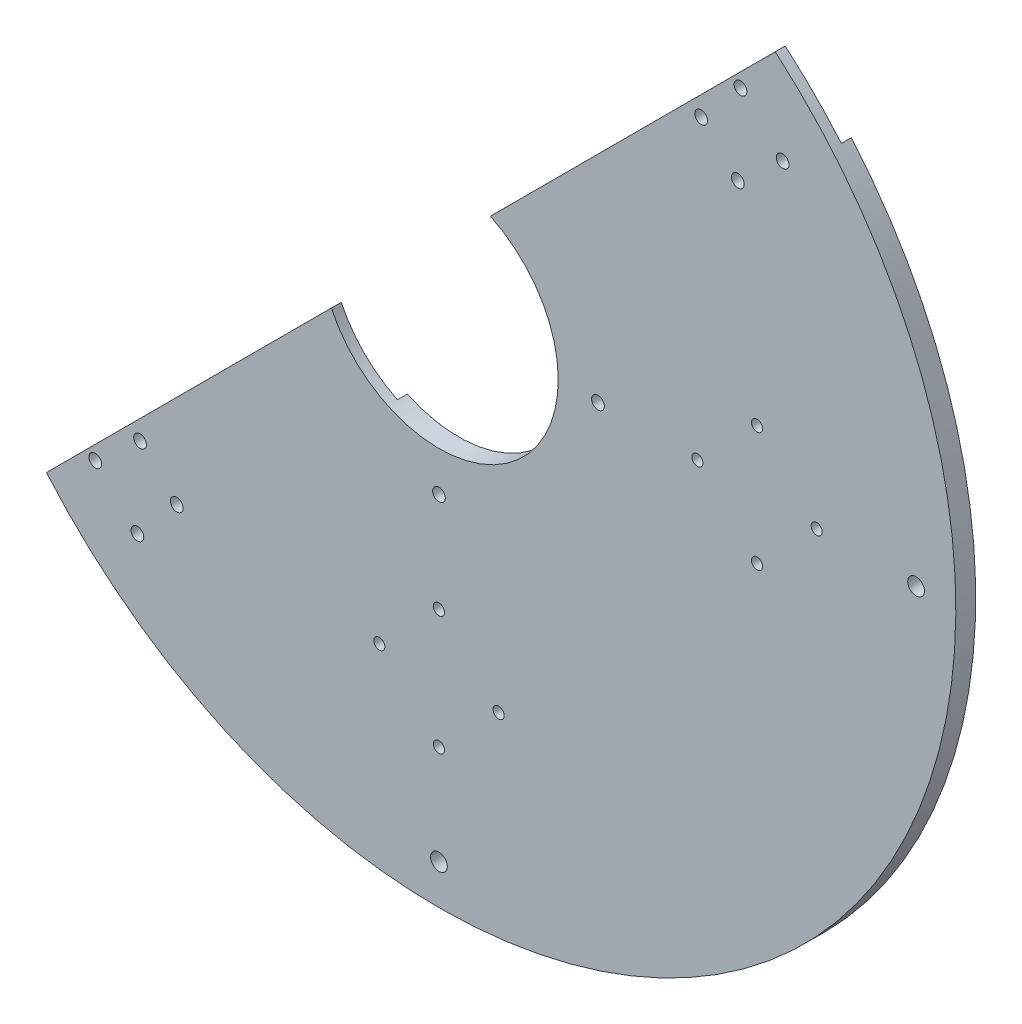
ISO-10303-21;
HEADER;
FILE_DESCRIPTION(('STEP AP214'),'2;1');
FILE_NAME('part.step','',(''),(''),'','','');
FILE_SCHEMA(('AUTOMOTIVE_DESIGN { 1 0 10303 214 1 1 1 1 }'));
ENDSEC;
DATA;
#1=APPLICATION_CONTEXT('core data for automotive mechanical design processes');
#2=APPLICATION_PROTOCOL_DEFINITION('international standard','automotive_design',2000,#1);
#3=PRODUCT_CONTEXT('',#1,'mechanical');
#4=PRODUCT('Part','Part','',(#3));
#5=PRODUCT_RELATED_PRODUCT_CATEGORY('part','',(#4));
#6=PRODUCT_DEFINITION_FORMATION('','',#4);
#7=PRODUCT_DEFINITION_CONTEXT('part definition',#1,'design');
#8=PRODUCT_DEFINITION('design','',#6,#7);
#9=PRODUCT_DEFINITION_SHAPE('','',#8);
#10=(LENGTH_UNIT() NAMED_UNIT(*) SI_UNIT(.MILLI.,.METRE.));
#11=(NAMED_UNIT(*) PLANE_ANGLE_UNIT() SI_UNIT($,.RADIAN.));
#12=(NAMED_UNIT(*) SI_UNIT($,.STERADIAN.) SOLID_ANGLE_UNIT());
#13=UNCERTAINTY_MEASURE_WITH_UNIT(LENGTH_MEASURE(1.E-05),#10,'distance_accuracy_value','');
#14=(GEOMETRIC_REPRESENTATION_CONTEXT(3) GLOBAL_UNCERTAINTY_ASSIGNED_CONTEXT((#13)) GLOBAL_UNIT_ASSIGNED_CONTEXT((#10,
#11,#12)) REPRESENTATION_CONTEXT('',''));
#15=CARTESIAN_POINT('',(0.,0.,0.));
#16=DIRECTION('',(0.,0.,1.));
#17=DIRECTION('',(1.,0.,0.));
#18=AXIS2_PLACEMENT_3D('',#15,#16,#17);
#19=CARTESIAN_POINT('',(0.,0.,5.));
#20=DIRECTION('',(0.,0.,1.));
#21=DIRECTION('',(1.,0.,0.));
#22=AXIS2_PLACEMENT_3D('',#19,#20,#21);
#23=PLANE('',#22);
#24=DIRECTION('',(0.707106781186549,0.707106781186546,0.));
#25=VECTOR('',#24,1.);
#26=CARTESIAN_POINT('',(-137.071067811866,-122.928932188134,5.));
#27=LINE('',#26,#25);
#28=CARTESIAN_POINT('',(-98.7225817109825,-84.5804460872511,5.));
#29=VERTEX_POINT('',#28);
#30=CARTESIAN_POINT('',(-27.0710678118655,-12.9289321881345,5.));
#31=VERTEX_POINT('',#30);
#32=EDGE_CURVE('E63',#29,#31,#27,.T.);
#33=ORIENTED_EDGE('',*,*,#32,.F.);
#34=CARTESIAN_POINT('',(0.,0.,5.));
#35=DIRECTION('',(0.,0.,1.));
#36=DIRECTION('',(1.,0.,0.));
#37=AXIS2_PLACEMENT_3D('',#34,#35,#36);
#38=CIRCLE('',#37,130.);
#39=CARTESIAN_POINT('',(84.5804460872515,98.7225817109821,5.));
#40=VERTEX_POINT('',#39);
#41=EDGE_CURVE('E127',#29,#40,#38,.T.);
#42=ORIENTED_EDGE('',*,*,#41,.T.);
#43=CARTESIAN_POINT('',(12.9289321881346,27.0710678118655,5.));
#44=VERTEX_POINT('',#43);
#45=EDGE_CURVE('E289',#44,#40,#27,.T.);
#46=ORIENTED_EDGE('',*,*,#45,.F.);
#47=CARTESIAN_POINT('',(0.,0.,5.));
#48=DIRECTION('',(0.,0.,1.));
#49=DIRECTION('',(1.,0.,0.));
#50=AXIS2_PLACEMENT_3D('',#47,#48,#49);
#51=CIRCLE('',#50,30.);
#52=EDGE_CURVE('E234',#31,#44,#51,.T.);
#53=ORIENTED_EDGE('',*,*,#52,.F.);
#54=EDGE_LOOP('',(#33,#42,#46,#53));
#55=FACE_BOUND('',#54,.T.);
#56=CARTESIAN_POINT('',(75.8408609766883,86.4474626944865,5.));
#57=DIRECTION('',(0.,0.,1.));
#58=DIRECTION('',(1.,0.,0.));
#59=AXIS2_PLACEMENT_3D('',#56,#57,#58);
#60=CIRCLE('',#59,1.60000000000001);
#61=CARTESIAN_POINT('',(77.4408609766883,86.4474626944865,5.));
#62=VERTEX_POINT('',#61);
#63=EDGE_CURVE('E138',#62,#62,#60,.F.);
#64=ORIENTED_EDGE('',*,*,#63,.T.);
#65=EDGE_LOOP('',(#64));
#66=FACE_BOUND('',#65,.T.);
#67=CARTESIAN_POINT('',(86.4474626944865,75.8408609766883,5.));
#68=DIRECTION('',(0.,0.,1.));
#69=DIRECTION('',(1.,0.,0.));
#70=AXIS2_PLACEMENT_3D('',#67,#68,#69);
#71=CIRCLE('',#70,1.60000000000001);
#72=CARTESIAN_POINT('',(88.0474626944865,75.8408609766883,5.));
#73=VERTEX_POINT('',#72);
#74=EDGE_CURVE('E142',#73,#73,#71,.F.);
#75=ORIENTED_EDGE('',*,*,#74,.T.);
#76=EDGE_LOOP('',(#75));
#77=FACE_BOUND('',#76,.T.);
#78=CARTESIAN_POINT('',(65.9485747623375,75.1717066908579,5.));
#79=DIRECTION('',(0.,0.,1.));
#80=DIRECTION('',(1.,0.,0.));
#81=AXIS2_PLACEMENT_3D('',#78,#79,#80);
#82=CIRCLE('',#81,1.60000000000001);
#83=CARTESIAN_POINT('',(67.5485747623375,75.1717066908579,5.));
#84=VERTEX_POINT('',#83);
#85=EDGE_CURVE('E145',#84,#84,#82,.F.);
#86=ORIENTED_EDGE('',*,*,#85,.T.);
#87=EDGE_LOOP('',(#86));
#88=FACE_BOUND('',#87,.T.);
#89=CARTESIAN_POINT('',(75.1717066908582,65.9485747623372,5.));
#90=DIRECTION('',(0.,0.,1.));
#91=DIRECTION('',(1.,0.,0.));
#92=AXIS2_PLACEMENT_3D('',#89,#90,#91);
#93=CIRCLE('',#92,1.60000000000002);
#94=CARTESIAN_POINT('',(76.7717066908582,65.9485747623372,5.));
#95=VERTEX_POINT('',#94);
#96=EDGE_CURVE('E148',#95,#95,#93,.F.);
#97=ORIENTED_EDGE('',*,*,#96,.T.);
#98=EDGE_LOOP('',(#97));
#99=FACE_BOUND('',#98,.T.);
#100=CARTESIAN_POINT('',(-65.948574762337,-75.1717066908584,5.));
#101=DIRECTION('',(0.,0.,1.));
#102=DIRECTION('',(1.,0.,0.));
#103=AXIS2_PLACEMENT_3D('',#100,#101,#102);
#104=CIRCLE('',#103,1.60000000000005);
#105=CARTESIAN_POINT('',(-64.348574762337,-75.1717066908584,5.));
#106=VERTEX_POINT('',#105);
#107=EDGE_CURVE('E151',#106,#106,#104,.F.);
#108=ORIENTED_EDGE('',*,*,#107,.T.);
#109=EDGE_LOOP('',(#108));
#110=FACE_BOUND('',#109,.T.);
#111=CARTESIAN_POINT('',(-75.1717066908577,-65.9485747623378,5.));
#112=DIRECTION('',(0.,0.,1.));
#113=DIRECTION('',(1.,0.,0.));
#114=AXIS2_PLACEMENT_3D('',#111,#112,#113);
#115=CIRCLE('',#114,1.60000000000003);
#116=CARTESIAN_POINT('',(-73.5717066908577,-65.9485747623378,5.));
#117=VERTEX_POINT('',#116);
#118=EDGE_CURVE('E154',#117,#117,#115,.F.);
#119=ORIENTED_EDGE('',*,*,#118,.T.);
#120=EDGE_LOOP('',(#119));
#121=FACE_BOUND('',#120,.T.);
#122=CARTESIAN_POINT('',(-75.840860976688,-86.4474626944868,5.));
#123=DIRECTION('',(0.,0.,1.));
#124=DIRECTION('',(1.,0.,0.));
#125=AXIS2_PLACEMENT_3D('',#122,#123,#124);
#126=CIRCLE('',#125,1.60000000000001);
#127=CARTESIAN_POINT('',(-74.240860976688,-86.4474626944868,5.));
#128=VERTEX_POINT('',#127);
#129=EDGE_CURVE('E157',#128,#128,#126,.F.);
#130=ORIENTED_EDGE('',*,*,#129,.T.);
#131=EDGE_LOOP('',(#130));
#132=FACE_BOUND('',#131,.T.);
#133=CARTESIAN_POINT('',(-86.4474626944863,-75.8408609766886,5.));
#134=DIRECTION('',(0.,0.,1.));
#135=DIRECTION('',(1.,0.,0.));
#136=AXIS2_PLACEMENT_3D('',#133,#134,#135);
#137=CIRCLE('',#136,1.60000000000001);
#138=CARTESIAN_POINT('',(-84.8474626944863,-75.8408609766886,5.));
#139=VERTEX_POINT('',#138);
#140=EDGE_CURVE('E137',#139,#139,#137,.F.);
#141=ORIENTED_EDGE('',*,*,#140,.T.);
#142=EDGE_LOOP('',(#141));
#143=FACE_BOUND('',#142,.T.);
#144=CARTESIAN_POINT('',(15.0000000000036,-80.,5.));
#145=DIRECTION('',(0.,0.,1.));
#146=DIRECTION('',(1.,0.,0.));
#147=AXIS2_PLACEMENT_3D('',#144,#145,#146);
#148=CIRCLE('',#147,1.39999999999878);
#149=CARTESIAN_POINT('',(16.4000000000024,-80.,5.));
#150=VERTEX_POINT('',#149);
#151=EDGE_CURVE('E206',#150,#150,#148,.T.);
#152=ORIENTED_EDGE('',*,*,#151,.F.);
#153=EDGE_LOOP('',(#152));
#154=FACE_BOUND('',#153,.T.);
#155=CARTESIAN_POINT('',(3.60479211679609E-12,-65.,5.));
#156=DIRECTION('',(0.,0.,1.));
#157=DIRECTION('',(1.,0.,0.));
#158=AXIS2_PLACEMENT_3D('',#155,#156,#157);
#159=CIRCLE('',#158,1.39999999999582);
#160=CARTESIAN_POINT('',(1.39999999999942,-65.,5.));
#161=VERTEX_POINT('',#160);
#162=EDGE_CURVE('E203',#161,#161,#159,.T.);
#163=ORIENTED_EDGE('',*,*,#162,.F.);
#164=EDGE_LOOP('',(#163));
#165=FACE_BOUND('',#164,.T.);
#166=CARTESIAN_POINT('',(-14.9999999999964,-80.,5.));
#167=DIRECTION('',(0.,0.,1.));
#168=DIRECTION('',(1.,0.,0.));
#169=AXIS2_PLACEMENT_3D('',#166,#167,#168);
#170=CIRCLE('',#169,1.40000000000123);
#171=CARTESIAN_POINT('',(-13.5999999999952,-80.,5.));
#172=VERTEX_POINT('',#171);
#173=EDGE_CURVE('E200',#172,#172,#170,.T.);
#174=ORIENTED_EDGE('',*,*,#173,.F.);
#175=EDGE_LOOP('',(#174));
#176=FACE_BOUND('',#175,.T.);
#177=CARTESIAN_POINT('',(95.0000000000018,1.80515151369613E-12,5.));
#178=DIRECTION('',(0.,0.,1.));
#179=DIRECTION('',(1.,0.,0.));
#180=AXIS2_PLACEMENT_3D('',#177,#178,#179);
#181=CIRCLE('',#180,1.40000000000152);
#182=CARTESIAN_POINT('',(96.4000000000033,1.80515151369613E-12,5.));
#183=VERTEX_POINT('',#182);
#184=EDGE_CURVE('E197',#183,#183,#181,.T.);
#185=ORIENTED_EDGE('',*,*,#184,.F.);
#186=EDGE_LOOP('',(#185));
#187=FACE_BOUND('',#186,.T.);
#188=CARTESIAN_POINT('',(3.61030302739226E-12,-95.,5.));
#189=DIRECTION('',(0.,0.,1.));
#190=DIRECTION('',(1.,0.,0.));
#191=AXIS2_PLACEMENT_3D('',#188,#189,#190);
#192=CIRCLE('',#191,1.40000000000409);
#193=CARTESIAN_POINT('',(1.4000000000077,-95.,5.));
#194=VERTEX_POINT('',#193);
#195=EDGE_CURVE('E194',#194,#194,#192,.T.);
#196=ORIENTED_EDGE('',*,*,#195,.F.);
#197=EDGE_LOOP('',(#196));
#198=FACE_BOUND('',#197,.T.);
#199=CARTESIAN_POINT('',(80.0000000000018,15.0000000000018,5.));
#200=DIRECTION('',(0.,0.,1.));
#201=DIRECTION('',(1.,0.,0.));
#202=AXIS2_PLACEMENT_3D('',#199,#200,#201);
#203=CIRCLE('',#202,1.39999999999761);
#204=CARTESIAN_POINT('',(81.3999999999994,15.0000000000018,5.));
#205=VERTEX_POINT('',#204);
#206=EDGE_CURVE('E191',#205,#205,#203,.T.);
#207=ORIENTED_EDGE('',*,*,#206,.F.);
#208=EDGE_LOOP('',(#207));
#209=FACE_BOUND('',#208,.T.);
#210=CARTESIAN_POINT('',(65.0000000000018,1.80147757329869E-12,5.));
#211=DIRECTION('',(0.,0.,1.));
#212=DIRECTION('',(1.,0.,0.));
#213=AXIS2_PLACEMENT_3D('',#210,#211,#212);
#214=CIRCLE('',#213,1.39999999999829);
#215=CARTESIAN_POINT('',(66.4000000000001,1.80147757329869E-12,5.));
#216=VERTEX_POINT('',#215);
#217=EDGE_CURVE('E188',#216,#216,#214,.T.);
#218=ORIENTED_EDGE('',*,*,#217,.F.);
#219=EDGE_LOOP('',(#218));
#220=FACE_BOUND('',#219,.T.);
#221=CARTESIAN_POINT('',(80.0000000000018,-14.9999999999982,5.));
#222=DIRECTION('',(0.,0.,1.));
#223=DIRECTION('',(1.,0.,0.));
#224=AXIS2_PLACEMENT_3D('',#221,#222,#223);
#225=CIRCLE('',#224,1.40000000000229);
#226=CARTESIAN_POINT('',(81.4000000000041,-14.9999999999982,5.));
#227=VERTEX_POINT('',#226);
#228=EDGE_CURVE('E185',#227,#227,#225,.T.);
#229=ORIENTED_EDGE('',*,*,#228,.F.);
#230=EDGE_LOOP('',(#229));
#231=FACE_BOUND('',#230,.T.);
#232=CARTESIAN_POINT('',(-2.79318507107451E-13,-40.,5.));
#233=DIRECTION('',(0.,0.,1.));
#234=DIRECTION('',(1.,0.,0.));
#235=AXIS2_PLACEMENT_3D('',#232,#233,#234);
#236=CIRCLE('',#235,1.6);
#237=CARTESIAN_POINT('',(1.59999999999972,-40.,5.));
#238=VERTEX_POINT('',#237);
#239=EDGE_CURVE('E210',#238,#238,#236,.T.);
#240=ORIENTED_EDGE('',*,*,#239,.F.);
#241=EDGE_LOOP('',(#240));
#242=FACE_BOUND('',#241,.T.);
#243=CARTESIAN_POINT('',(120.,-4.18977760661176E-13,5.));
#244=DIRECTION('',(0.,0.,1.));
#245=DIRECTION('',(1.,0.,0.));
#246=AXIS2_PLACEMENT_3D('',#243,#244,#245);
#247=CIRCLE('',#246,2.1);
#248=CARTESIAN_POINT('',(122.1,-4.18977760661176E-13,5.));
#249=VERTEX_POINT('',#248);
#250=EDGE_CURVE('E228',#249,#249,#247,.T.);
#251=ORIENTED_EDGE('',*,*,#250,.F.);
#252=EDGE_LOOP('',(#251));
#253=FACE_BOUND('',#252,.T.);
#254=CARTESIAN_POINT('',(-8.37955521322352E-13,-120.,5.));
#255=DIRECTION('',(0.,0.,1.));
#256=DIRECTION('',(1.,0.,0.));
#257=AXIS2_PLACEMENT_3D('',#254,#255,#256);
#258=CIRCLE('',#257,2.1);
#259=CARTESIAN_POINT('',(2.09999999999916,-120.,5.));
#260=VERTEX_POINT('',#259);
#261=EDGE_CURVE('E222',#260,#260,#258,.T.);
#262=ORIENTED_EDGE('',*,*,#261,.F.);
#263=EDGE_LOOP('',(#262));
#264=FACE_BOUND('',#263,.T.);
#265=CARTESIAN_POINT('',(40.,-1.39659253553725E-13,5.));
#266=DIRECTION('',(0.,0.,1.));
#267=DIRECTION('',(1.,0.,0.));
#268=AXIS2_PLACEMENT_3D('',#265,#266,#267);
#269=CIRCLE('',#268,1.6);
#270=CARTESIAN_POINT('',(41.6,-1.39659253553725E-13,5.));
#271=VERTEX_POINT('',#270);
#272=EDGE_CURVE('E216',#271,#271,#269,.T.);
#273=ORIENTED_EDGE('',*,*,#272,.F.);
#274=EDGE_LOOP('',(#273));
#275=FACE_BOUND('',#274,.T.);
#276=ADVANCED_FACE('F40',(#55,#66,#77,#88,#99,#110,#121,#132,#143,#154,#165,#176,#187,#198,#209,
#220,#231,#242,#253,#264,#275),#23,.T.);
#277=CARTESIAN_POINT('',(0.,0.,0.));
#278=DIRECTION('',(0.,0.,1.));
#279=DIRECTION('',(1.,0.,0.));
#280=AXIS2_PLACEMENT_3D('',#277,#278,#279);
#281=PLANE('',#280);
#282=CARTESIAN_POINT('',(15.0000000000036,-80.,0.));
#283=DIRECTION('',(0.,0.,1.));
#284=DIRECTION('',(1.,0.,0.));
#285=AXIS2_PLACEMENT_3D('',#282,#283,#284);
#286=CIRCLE('',#285,1.39999999999878);
#287=CARTESIAN_POINT('',(16.4000000000024,-80.,0.));
#288=VERTEX_POINT('',#287);
#289=EDGE_CURVE('E141',#288,#288,#286,.T.);
#290=ORIENTED_EDGE('',*,*,#289,.T.);
#291=EDGE_LOOP('',(#290));
#292=FACE_BOUND('',#291,.T.);
#293=CARTESIAN_POINT('',(3.60479211679609E-12,-65.,0.));
#294=DIRECTION('',(0.,0.,1.));
#295=DIRECTION('',(1.,0.,0.));
#296=AXIS2_PLACEMENT_3D('',#293,#294,#295);
#297=CIRCLE('',#296,1.39999999999582);
#298=CARTESIAN_POINT('',(1.39999999999942,-65.,0.));
#299=VERTEX_POINT('',#298);
#300=EDGE_CURVE('E164',#299,#299,#297,.T.);
#301=ORIENTED_EDGE('',*,*,#300,.T.);
#302=EDGE_LOOP('',(#301));
#303=FACE_BOUND('',#302,.T.);
#304=CARTESIAN_POINT('',(-14.9999999999964,-80.,0.));
#305=DIRECTION('',(0.,0.,1.));
#306=DIRECTION('',(1.,0.,0.));
#307=AXIS2_PLACEMENT_3D('',#304,#305,#306);
#308=CIRCLE('',#307,1.40000000000123);
#309=CARTESIAN_POINT('',(-13.5999999999952,-80.,0.));
#310=VERTEX_POINT('',#309);
#311=EDGE_CURVE('E165',#310,#310,#308,.T.);
#312=ORIENTED_EDGE('',*,*,#311,.T.);
#313=EDGE_LOOP('',(#312));
#314=FACE_BOUND('',#313,.T.);
#315=CARTESIAN_POINT('',(95.0000000000018,1.80515151369613E-12,0.));
#316=DIRECTION('',(0.,0.,1.));
#317=DIRECTION('',(1.,0.,0.));
#318=AXIS2_PLACEMENT_3D('',#315,#316,#317);
#319=CIRCLE('',#318,1.40000000000152);
#320=CARTESIAN_POINT('',(96.4000000000033,1.80515151369613E-12,0.));
#321=VERTEX_POINT('',#320);
#322=EDGE_CURVE('E180',#321,#321,#319,.T.);
#323=ORIENTED_EDGE('',*,*,#322,.T.);
#324=EDGE_LOOP('',(#323));
#325=FACE_BOUND('',#324,.T.);
#326=CARTESIAN_POINT('',(3.61030302739226E-12,-95.,0.));
#327=DIRECTION('',(0.,0.,1.));
#328=DIRECTION('',(1.,0.,0.));
#329=AXIS2_PLACEMENT_3D('',#326,#327,#328);
#330=CIRCLE('',#329,1.40000000000409);
#331=CARTESIAN_POINT('',(1.4000000000077,-95.,0.));
#332=VERTEX_POINT('',#331);
#333=EDGE_CURVE('E168',#332,#332,#330,.T.);
#334=ORIENTED_EDGE('',*,*,#333,.T.);
#335=EDGE_LOOP('',(#334));
#336=FACE_BOUND('',#335,.T.);
#337=CARTESIAN_POINT('',(80.0000000000018,15.0000000000018,0.));
#338=DIRECTION('',(0.,0.,1.));
#339=DIRECTION('',(1.,0.,0.));
#340=AXIS2_PLACEMENT_3D('',#337,#338,#339);
#341=CIRCLE('',#340,1.39999999999761);
#342=CARTESIAN_POINT('',(81.3999999999994,15.0000000000018,0.));
#343=VERTEX_POINT('',#342);
#344=EDGE_CURVE('E171',#343,#343,#341,.T.);
#345=ORIENTED_EDGE('',*,*,#344,.T.);
#346=EDGE_LOOP('',(#345));
#347=FACE_BOUND('',#346,.T.);
#348=CARTESIAN_POINT('',(65.0000000000018,1.80147757329869E-12,0.));
#349=DIRECTION('',(0.,0.,1.));
#350=DIRECTION('',(1.,0.,0.));
#351=AXIS2_PLACEMENT_3D('',#348,#349,#350);
#352=CIRCLE('',#351,1.39999999999829);
#353=CARTESIAN_POINT('',(66.4000000000001,1.80147757329869E-12,0.));
#354=VERTEX_POINT('',#353);
#355=EDGE_CURVE('E174',#354,#354,#352,.T.);
#356=ORIENTED_EDGE('',*,*,#355,.T.);
#357=EDGE_LOOP('',(#356));
#358=FACE_BOUND('',#357,.T.);
#359=CARTESIAN_POINT('',(80.0000000000018,-14.9999999999982,0.));
#360=DIRECTION('',(0.,0.,1.));
#361=DIRECTION('',(1.,0.,0.));
#362=AXIS2_PLACEMENT_3D('',#359,#360,#361);
#363=CIRCLE('',#362,1.40000000000229);
#364=CARTESIAN_POINT('',(81.4000000000041,-14.9999999999982,0.));
#365=VERTEX_POINT('',#364);
#366=EDGE_CURVE('E177',#365,#365,#363,.T.);
#367=ORIENTED_EDGE('',*,*,#366,.T.);
#368=EDGE_LOOP('',(#367));
#369=FACE_BOUND('',#368,.T.);
#370=CARTESIAN_POINT('',(0.,0.,0.));
#371=DIRECTION('',(0.,0.,1.));
#372=DIRECTION('',(1.,0.,0.));
#373=AXIS2_PLACEMENT_3D('',#370,#371,#372);
#374=CIRCLE('',#373,130.);
#375=CARTESIAN_POINT('',(-84.5804460872575,-98.7225817109752,0.));
#376=VERTEX_POINT('',#375);
#377=CARTESIAN_POINT('',(98.7225817109754,84.580446087257,0.));
#378=VERTEX_POINT('',#377);
#379=EDGE_CURVE('E237',#376,#378,#374,.T.);
#380=ORIENTED_EDGE('',*,*,#379,.F.);
#381=DIRECTION('',(0.707106781186549,0.707106781186546,0.));
#382=VECTOR('',#381,1.);
#383=CARTESIAN_POINT('',(-122.928932188141,-137.071067811859,0.));
#384=LINE('',#383,#382);
#385=CARTESIAN_POINT('',(-12.9289321881387,-27.0710678118567,0.));
#386=VERTEX_POINT('',#385);
#387=EDGE_CURVE('E247',#376,#386,#384,.T.);
#388=ORIENTED_EDGE('',*,*,#387,.T.);
#389=CARTESIAN_POINT('',(0.,0.,0.));
#390=DIRECTION('',(0.,0.,1.));
#391=DIRECTION('',(1.,0.,0.));
#392=AXIS2_PLACEMENT_3D('',#389,#390,#391);
#393=CIRCLE('',#392,30.);
#394=CARTESIAN_POINT('',(27.0710678118568,12.9289321881386,0.));
#395=VERTEX_POINT('',#394);
#396=EDGE_CURVE('E231',#386,#395,#393,.T.);
#397=ORIENTED_EDGE('',*,*,#396,.T.);
#398=EDGE_CURVE('E256',#395,#378,#384,.T.);
#399=ORIENTED_EDGE('',*,*,#398,.T.);
#400=EDGE_LOOP('',(#380,#388,#397,#399));
#401=FACE_BOUND('',#400,.T.);
#402=CARTESIAN_POINT('',(120.,-4.18977760661176E-13,0.));
#403=DIRECTION('',(0.,0.,1.));
#404=DIRECTION('',(1.,0.,0.));
#405=AXIS2_PLACEMENT_3D('',#402,#403,#404);
#406=CIRCLE('',#405,2.1);
#407=CARTESIAN_POINT('',(122.1,-4.18977760661176E-13,0.));
#408=VERTEX_POINT('',#407);
#409=EDGE_CURVE('E225',#408,#408,#406,.T.);
#410=ORIENTED_EDGE('',*,*,#409,.T.);
#411=EDGE_LOOP('',(#410));
#412=FACE_BOUND('',#411,.T.);
#413=CARTESIAN_POINT('',(-8.37955521322352E-13,-120.,0.));
#414=DIRECTION('',(0.,0.,1.));
#415=DIRECTION('',(1.,0.,0.));
#416=AXIS2_PLACEMENT_3D('',#413,#414,#415);
#417=CIRCLE('',#416,2.1);
#418=CARTESIAN_POINT('',(2.09999999999916,-120.,0.));
#419=VERTEX_POINT('',#418);
#420=EDGE_CURVE('E219',#419,#419,#417,.T.);
#421=ORIENTED_EDGE('',*,*,#420,.T.);
#422=EDGE_LOOP('',(#421));
#423=FACE_BOUND('',#422,.T.);
#424=CARTESIAN_POINT('',(40.,-1.39659253553725E-13,0.));
#425=DIRECTION('',(0.,0.,1.));
#426=DIRECTION('',(1.,0.,0.));
#427=AXIS2_PLACEMENT_3D('',#424,#425,#426);
#428=CIRCLE('',#427,1.6);
#429=CARTESIAN_POINT('',(41.6,-1.39659253553725E-13,0.));
#430=VERTEX_POINT('',#429);
#431=EDGE_CURVE('E213',#430,#430,#428,.T.);
#432=ORIENTED_EDGE('',*,*,#431,.T.);
#433=EDGE_LOOP('',(#432));
#434=FACE_BOUND('',#433,.T.);
#435=CARTESIAN_POINT('',(-2.79318507107451E-13,-40.,0.));
#436=DIRECTION('',(0.,0.,1.));
#437=DIRECTION('',(1.,0.,0.));
#438=AXIS2_PLACEMENT_3D('',#435,#436,#437);
#439=CIRCLE('',#438,1.6);
#440=CARTESIAN_POINT('',(1.59999999999972,-40.,0.));
#441=VERTEX_POINT('',#440);
#442=EDGE_CURVE('E209',#441,#441,#439,.T.);
#443=ORIENTED_EDGE('',*,*,#442,.T.);
#444=EDGE_LOOP('',(#443));
#445=FACE_BOUND('',#444,.T.);
#446=ADVANCED_FACE('F296',(#292,#303,#314,#325,#336,#347,#358,#369,#401,#412,#423,#434,#445),
#281,.F.);
#447=CARTESIAN_POINT('',(0.,0.,5.));
#448=DIRECTION('',(0.,0.,-1.));
#449=DIRECTION('',(-1.,0.,0.));
#450=AXIS2_PLACEMENT_3D('',#447,#448,#449);
#451=CYLINDRICAL_SURFACE('',#450,130.);
#452=ORIENTED_EDGE('',*,*,#379,.T.);
#453=DIRECTION('',(0.,0.,-1.));
#454=VECTOR('',#453,1.);
#455=CARTESIAN_POINT('',(98.7225817109884,84.5804460872442,4.99999999996357));
#456=LINE('',#455,#454);
#457=CARTESIAN_POINT('',(98.7225817109824,84.5804460872512,2.5));
#458=VERTEX_POINT('',#457);
#459=EDGE_CURVE('E128',#378,#458,#456,.F.);
#460=ORIENTED_EDGE('',*,*,#459,.T.);
#461=CARTESIAN_POINT('',(0.,0.,2.5));
#462=DIRECTION('',(0.,0.,1.));
#463=DIRECTION('',(1.,0.,0.));
#464=AXIS2_PLACEMENT_3D('',#461,#462,#463);
#465=CIRCLE('',#464,130.);
#466=CARTESIAN_POINT('',(84.5804460872515,98.7225817109821,2.5));
#467=VERTEX_POINT('',#466);
#468=EDGE_CURVE('E116',#458,#467,#465,.T.);
#469=ORIENTED_EDGE('',*,*,#468,.T.);
#470=DIRECTION('',(0.,0.,-1.));
#471=VECTOR('',#470,1.);
#472=CARTESIAN_POINT('',(84.5804460872515,98.7225817109821,5.));
#473=LINE('',#472,#471);
#474=EDGE_CURVE('E129',#467,#40,#473,.F.);
#475=ORIENTED_EDGE('',*,*,#474,.T.);
#476=ORIENTED_EDGE('',*,*,#41,.F.);
#477=DIRECTION('',(0.,0.,-1.));
#478=VECTOR('',#477,1.);
#479=CARTESIAN_POINT('',(-98.7225817109825,-84.5804460872511,5.));
#480=LINE('',#479,#478);
#481=CARTESIAN_POINT('',(-98.7225817109825,-84.5804460872511,2.5));
#482=VERTEX_POINT('',#481);
#483=EDGE_CURVE('E120',#29,#482,#480,.T.);
#484=ORIENTED_EDGE('',*,*,#483,.T.);
#485=CARTESIAN_POINT('',(-84.5804460872515,-98.7225817109821,2.5));
#486=VERTEX_POINT('',#485);
#487=EDGE_CURVE('E106',#482,#486,#465,.T.);
#488=ORIENTED_EDGE('',*,*,#487,.T.);
#489=DIRECTION('',(0.,0.,-1.));
#490=VECTOR('',#489,1.);
#491=CARTESIAN_POINT('',(-84.5804460872446,-98.722581710988,4.99999999996357));
#492=LINE('',#491,#490);
#493=EDGE_CURVE('E132',#486,#376,#492,.T.);
#494=ORIENTED_EDGE('',*,*,#493,.T.);
#495=EDGE_LOOP('',(#452,#460,#469,#475,#476,#484,#488,#494));
#496=FACE_BOUND('',#495,.T.);
#497=ADVANCED_FACE('F42',(#496),#451,.T.);
#498=CARTESIAN_POINT('',(0.,0.,5.));
#499=DIRECTION('',(0.,0.,-1.));
#500=DIRECTION('',(-1.,0.,0.));
#501=AXIS2_PLACEMENT_3D('',#498,#499,#500);
#502=CYLINDRICAL_SURFACE('',#501,30.);
#503=DIRECTION('',(0.,0.,-1.));
#504=VECTOR('',#503,1.);
#505=CARTESIAN_POINT('',(-12.9289321881259,-27.0710678118696,4.99999999996357));
#506=LINE('',#505,#504);
#507=CARTESIAN_POINT('',(-12.9289321881346,-27.0710678118654,2.5));
#508=VERTEX_POINT('',#507);
#509=EDGE_CURVE('E11',#508,#386,#506,.T.);
#510=ORIENTED_EDGE('',*,*,#509,.F.);
#511=CARTESIAN_POINT('',(0.,0.,2.5));
#512=DIRECTION('',(0.,0.,1.));
#513=DIRECTION('',(1.,0.,0.));
#514=AXIS2_PLACEMENT_3D('',#511,#512,#513);
#515=CIRCLE('',#514,30.);
#516=CARTESIAN_POINT('',(-27.0710678118655,-12.9289321881345,2.5));
#517=VERTEX_POINT('',#516);
#518=EDGE_CURVE('E266',#517,#508,#515,.T.);
#519=ORIENTED_EDGE('',*,*,#518,.F.);
#520=DIRECTION('',(0.,0.,-1.));
#521=VECTOR('',#520,1.);
#522=CARTESIAN_POINT('',(-27.0710678118655,-12.9289321881345,5.));
#523=LINE('',#522,#521);
#524=EDGE_CURVE('E48',#31,#517,#523,.T.);
#525=ORIENTED_EDGE('',*,*,#524,.F.);
#526=ORIENTED_EDGE('',*,*,#52,.T.);
#527=DIRECTION('',(0.,0.,-1.));
#528=VECTOR('',#527,1.);
#529=CARTESIAN_POINT('',(12.9289321881346,27.0710678118655,5.));
#530=LINE('',#529,#528);
#531=CARTESIAN_POINT('',(12.9289321881346,27.0710678118655,2.5));
#532=VERTEX_POINT('',#531);
#533=EDGE_CURVE('E241',#532,#44,#530,.F.);
#534=ORIENTED_EDGE('',*,*,#533,.F.);
#535=CARTESIAN_POINT('',(27.0710678118655,12.9289321881345,2.5));
#536=VERTEX_POINT('',#535);
#537=EDGE_CURVE('E117',#536,#532,#515,.T.);
#538=ORIENTED_EDGE('',*,*,#537,.F.);
#539=DIRECTION('',(0.,0.,-1.));
#540=VECTOR('',#539,1.);
#541=CARTESIAN_POINT('',(27.0710678118697,12.9289321881258,4.99999999996357));
#542=LINE('',#541,#540);
#543=EDGE_CURVE('E249',#395,#536,#542,.F.);
#544=ORIENTED_EDGE('',*,*,#543,.F.);
#545=ORIENTED_EDGE('',*,*,#396,.F.);
#546=EDGE_LOOP('',(#510,#519,#525,#526,#534,#538,#544,#545));
#547=FACE_BOUND('',#546,.T.);
#548=ADVANCED_FACE('F265',(#547),#502,.F.);
#549=CARTESIAN_POINT('',(120.,-4.18977760661176E-13,5.));
#550=DIRECTION('',(0.,0.,-1.));
#551=DIRECTION('',(-1.,0.,0.));
#552=AXIS2_PLACEMENT_3D('',#549,#550,#551);
#553=CYLINDRICAL_SURFACE('',#552,2.1);
#554=ORIENTED_EDGE('',*,*,#250,.T.);
#555=EDGE_LOOP('',(#554));
#556=FACE_BOUND('',#555,.T.);
#557=ORIENTED_EDGE('',*,*,#409,.F.);
#558=EDGE_LOOP('',(#557));
#559=FACE_BOUND('',#558,.T.);
#560=ADVANCED_FACE('F374',(#556,#559),#553,.F.);
#561=CARTESIAN_POINT('',(-8.37955521322352E-13,-120.,5.));
#562=DIRECTION('',(0.,0.,-1.));
#563=DIRECTION('',(-1.,0.,0.));
#564=AXIS2_PLACEMENT_3D('',#561,#562,#563);
#565=CYLINDRICAL_SURFACE('',#564,2.1);
#566=ORIENTED_EDGE('',*,*,#261,.T.);
#567=EDGE_LOOP('',(#566));
#568=FACE_BOUND('',#567,.T.);
#569=ORIENTED_EDGE('',*,*,#420,.F.);
#570=EDGE_LOOP('',(#569));
#571=FACE_BOUND('',#570,.T.);
#572=ADVANCED_FACE('F349',(#568,#571),#565,.F.);
#573=CARTESIAN_POINT('',(40.,-1.39659253553725E-13,5.));
#574=DIRECTION('',(0.,0.,-1.));
#575=DIRECTION('',(-1.,0.,0.));
#576=AXIS2_PLACEMENT_3D('',#573,#574,#575);
#577=CYLINDRICAL_SURFACE('',#576,1.6);
#578=ORIENTED_EDGE('',*,*,#272,.T.);
#579=EDGE_LOOP('',(#578));
#580=FACE_BOUND('',#579,.T.);
#581=ORIENTED_EDGE('',*,*,#431,.F.);
#582=EDGE_LOOP('',(#581));
#583=FACE_BOUND('',#582,.T.);
#584=ADVANCED_FACE('F345',(#580,#583),#577,.F.);
#585=CARTESIAN_POINT('',(-2.79318507107451E-13,-40.,5.));
#586=DIRECTION('',(0.,0.,-1.));
#587=DIRECTION('',(-1.,0.,0.));
#588=AXIS2_PLACEMENT_3D('',#585,#586,#587);
#589=CYLINDRICAL_SURFACE('',#588,1.6);
#590=ORIENTED_EDGE('',*,*,#239,.T.);
#591=EDGE_LOOP('',(#590));
#592=FACE_BOUND('',#591,.T.);
#593=ORIENTED_EDGE('',*,*,#442,.F.);
#594=EDGE_LOOP('',(#593));
#595=FACE_BOUND('',#594,.T.);
#596=ADVANCED_FACE('F348',(#592,#595),#589,.F.);
#597=CARTESIAN_POINT('',(80.0000000000018,-14.9999999999982,0.));
#598=DIRECTION('',(0.,0.,1.));
#599=DIRECTION('',(1.,0.,0.));
#600=AXIS2_PLACEMENT_3D('',#597,#598,#599);
#601=CYLINDRICAL_SURFACE('',#600,1.40000000000229);
#602=ORIENTED_EDGE('',*,*,#228,.T.);
#603=EDGE_LOOP('',(#602));
#604=FACE_BOUND('',#603,.T.);
#605=ORIENTED_EDGE('',*,*,#366,.F.);
#606=EDGE_LOOP('',(#605));
#607=FACE_BOUND('',#606,.T.);
#608=ADVANCED_FACE('F359',(#604,#607),#601,.F.);
#609=CARTESIAN_POINT('',(65.0000000000018,1.80147757329869E-12,0.));
#610=DIRECTION('',(0.,0.,1.));
#611=DIRECTION('',(1.,0.,0.));
#612=AXIS2_PLACEMENT_3D('',#609,#610,#611);
#613=CYLINDRICAL_SURFACE('',#612,1.39999999999829);
#614=ORIENTED_EDGE('',*,*,#217,.T.);
#615=EDGE_LOOP('',(#614));
#616=FACE_BOUND('',#615,.T.);
#617=ORIENTED_EDGE('',*,*,#355,.F.);
#618=EDGE_LOOP('',(#617));
#619=FACE_BOUND('',#618,.T.);
#620=ADVANCED_FACE('F365',(#616,#619),#613,.F.);
#621=CARTESIAN_POINT('',(80.0000000000018,15.0000000000018,0.));
#622=DIRECTION('',(0.,0.,1.));
#623=DIRECTION('',(1.,0.,0.));
#624=AXIS2_PLACEMENT_3D('',#621,#622,#623);
#625=CYLINDRICAL_SURFACE('',#624,1.39999999999761);
#626=ORIENTED_EDGE('',*,*,#206,.T.);
#627=EDGE_LOOP('',(#626));
#628=FACE_BOUND('',#627,.T.);
#629=ORIENTED_EDGE('',*,*,#344,.F.);
#630=EDGE_LOOP('',(#629));
#631=FACE_BOUND('',#630,.T.);
#632=ADVANCED_FACE('F625',(#628,#631),#625,.F.);
#633=CARTESIAN_POINT('',(3.61030302739226E-12,-95.,0.));
#634=DIRECTION('',(0.,0.,1.));
#635=DIRECTION('',(1.,0.,0.));
#636=AXIS2_PLACEMENT_3D('',#633,#634,#635);
#637=CYLINDRICAL_SURFACE('',#636,1.40000000000409);
#638=ORIENTED_EDGE('',*,*,#195,.T.);
#639=EDGE_LOOP('',(#638));
#640=FACE_BOUND('',#639,.T.);
#641=ORIENTED_EDGE('',*,*,#333,.F.);
#642=EDGE_LOOP('',(#641));
#643=FACE_BOUND('',#642,.T.);
#644=ADVANCED_FACE('F618',(#640,#643),#637,.F.);
#645=CARTESIAN_POINT('',(95.0000000000018,1.80515151369613E-12,0.));
#646=DIRECTION('',(0.,0.,1.));
#647=DIRECTION('',(1.,0.,0.));
#648=AXIS2_PLACEMENT_3D('',#645,#646,#647);
#649=CYLINDRICAL_SURFACE('',#648,1.40000000000152);
#650=ORIENTED_EDGE('',*,*,#184,.T.);
#651=EDGE_LOOP('',(#650));
#652=FACE_BOUND('',#651,.T.);
#653=ORIENTED_EDGE('',*,*,#322,.F.);
#654=EDGE_LOOP('',(#653));
#655=FACE_BOUND('',#654,.T.);
#656=ADVANCED_FACE('F369',(#652,#655),#649,.F.);
#657=CARTESIAN_POINT('',(-14.9999999999964,-80.,0.));
#658=DIRECTION('',(0.,0.,1.));
#659=DIRECTION('',(1.,0.,0.));
#660=AXIS2_PLACEMENT_3D('',#657,#658,#659);
#661=CYLINDRICAL_SURFACE('',#660,1.40000000000123);
#662=ORIENTED_EDGE('',*,*,#173,.T.);
#663=EDGE_LOOP('',(#662));
#664=FACE_BOUND('',#663,.T.);
#665=ORIENTED_EDGE('',*,*,#311,.F.);
#666=EDGE_LOOP('',(#665));
#667=FACE_BOUND('',#666,.T.);
#668=ADVANCED_FACE('F604',(#664,#667),#661,.F.);
#669=CARTESIAN_POINT('',(3.60479211679609E-12,-65.,0.));
#670=DIRECTION('',(0.,0.,1.));
#671=DIRECTION('',(1.,0.,0.));
#672=AXIS2_PLACEMENT_3D('',#669,#670,#671);
#673=CYLINDRICAL_SURFACE('',#672,1.39999999999582);
#674=ORIENTED_EDGE('',*,*,#162,.T.);
#675=EDGE_LOOP('',(#674));
#676=FACE_BOUND('',#675,.T.);
#677=ORIENTED_EDGE('',*,*,#300,.F.);
#678=EDGE_LOOP('',(#677));
#679=FACE_BOUND('',#678,.T.);
#680=ADVANCED_FACE('F597',(#676,#679),#673,.F.);
#681=CARTESIAN_POINT('',(15.0000000000036,-80.,0.));
#682=DIRECTION('',(0.,0.,1.));
#683=DIRECTION('',(1.,0.,0.));
#684=AXIS2_PLACEMENT_3D('',#681,#682,#683);
#685=CYLINDRICAL_SURFACE('',#684,1.39999999999878);
#686=ORIENTED_EDGE('',*,*,#151,.T.);
#687=EDGE_LOOP('',(#686));
#688=FACE_BOUND('',#687,.T.);
#689=ORIENTED_EDGE('',*,*,#289,.F.);
#690=EDGE_LOOP('',(#689));
#691=FACE_BOUND('',#690,.T.);
#692=ADVANCED_FACE('F402',(#688,#691),#685,.F.);
#693=CARTESIAN_POINT('',(-86.4474626944863,-75.8408609766886,5.001));
#694=DIRECTION('',(0.,0.,-1.));
#695=DIRECTION('',(-1.,0.,0.));
#696=AXIS2_PLACEMENT_3D('',#693,#694,#695);
#697=CYLINDRICAL_SURFACE('',#696,1.60000000000001);
#698=CARTESIAN_POINT('',(-86.4474626944863,-75.8408609766886,2.5));
#699=DIRECTION('',(0.,0.,1.));
#700=DIRECTION('',(1.,0.,0.));
#701=AXIS2_PLACEMENT_3D('',#698,#699,#700);
#702=CIRCLE('',#701,1.60000000000001);
#703=CARTESIAN_POINT('',(-84.8474626944863,-75.8408609766886,2.5));
#704=VERTEX_POINT('',#703);
#705=EDGE_CURVE('E268',#704,#704,#702,.F.);
#706=ORIENTED_EDGE('',*,*,#705,.T.);
#707=EDGE_LOOP('',(#706));
#708=FACE_BOUND('',#707,.T.);
#709=ORIENTED_EDGE('',*,*,#140,.F.);
#710=EDGE_LOOP('',(#709));
#711=FACE_BOUND('',#710,.T.);
#712=ADVANCED_FACE('F426',(#708,#711),#697,.F.);
#713=CARTESIAN_POINT('',(-75.840860976688,-86.4474626944868,5.001));
#714=DIRECTION('',(0.,0.,-1.));
#715=DIRECTION('',(-1.,0.,0.));
#716=AXIS2_PLACEMENT_3D('',#713,#714,#715);
#717=CYLINDRICAL_SURFACE('',#716,1.60000000000001);
#718=CARTESIAN_POINT('',(-75.840860976688,-86.4474626944868,2.5));
#719=DIRECTION('',(0.,0.,1.));
#720=DIRECTION('',(1.,0.,0.));
#721=AXIS2_PLACEMENT_3D('',#718,#719,#720);
#722=CIRCLE('',#721,1.60000000000001);
#723=CARTESIAN_POINT('',(-74.240860976688,-86.4474626944868,2.5));
#724=VERTEX_POINT('',#723);
#725=EDGE_CURVE('E272',#724,#724,#722,.F.);
#726=ORIENTED_EDGE('',*,*,#725,.T.);
#727=EDGE_LOOP('',(#726));
#728=FACE_BOUND('',#727,.T.);
#729=ORIENTED_EDGE('',*,*,#129,.F.);
#730=EDGE_LOOP('',(#729));
#731=FACE_BOUND('',#730,.T.);
#732=ADVANCED_FACE('F432',(#728,#731),#717,.F.);
#733=CARTESIAN_POINT('',(-75.1717066908577,-65.9485747623378,5.001));
#734=DIRECTION('',(0.,0.,-1.));
#735=DIRECTION('',(-1.,0.,0.));
#736=AXIS2_PLACEMENT_3D('',#733,#734,#735);
#737=CYLINDRICAL_SURFACE('',#736,1.60000000000003);
#738=CARTESIAN_POINT('',(-75.1717066908577,-65.9485747623378,2.5));
#739=DIRECTION('',(0.,0.,1.));
#740=DIRECTION('',(1.,0.,0.));
#741=AXIS2_PLACEMENT_3D('',#738,#739,#740);
#742=CIRCLE('',#741,1.60000000000003);
#743=CARTESIAN_POINT('',(-73.5717066908577,-65.9485747623378,2.5));
#744=VERTEX_POINT('',#743);
#745=EDGE_CURVE('E275',#744,#744,#742,.F.);
#746=ORIENTED_EDGE('',*,*,#745,.T.);
#747=EDGE_LOOP('',(#746));
#748=FACE_BOUND('',#747,.T.);
#749=ORIENTED_EDGE('',*,*,#118,.F.);
#750=EDGE_LOOP('',(#749));
#751=FACE_BOUND('',#750,.T.);
#752=ADVANCED_FACE('F444',(#748,#751),#737,.F.);
#753=CARTESIAN_POINT('',(-65.948574762337,-75.1717066908584,5.001));
#754=DIRECTION('',(0.,0.,-1.));
#755=DIRECTION('',(-1.,0.,0.));
#756=AXIS2_PLACEMENT_3D('',#753,#754,#755);
#757=CYLINDRICAL_SURFACE('',#756,1.60000000000005);
#758=CARTESIAN_POINT('',(-65.948574762337,-75.1717066908584,2.5));
#759=DIRECTION('',(0.,0.,1.));
#760=DIRECTION('',(1.,0.,0.));
#761=AXIS2_PLACEMENT_3D('',#758,#759,#760);
#762=CIRCLE('',#761,1.60000000000005);
#763=CARTESIAN_POINT('',(-64.348574762337,-75.1717066908584,2.5));
#764=VERTEX_POINT('',#763);
#765=EDGE_CURVE('E278',#764,#764,#762,.F.);
#766=ORIENTED_EDGE('',*,*,#765,.T.);
#767=EDGE_LOOP('',(#766));
#768=FACE_BOUND('',#767,.T.);
#769=ORIENTED_EDGE('',*,*,#107,.F.);
#770=EDGE_LOOP('',(#769));
#771=FACE_BOUND('',#770,.T.);
#772=ADVANCED_FACE('F456',(#768,#771),#757,.F.);
#773=CARTESIAN_POINT('',(75.1717066908582,65.9485747623372,5.001));
#774=DIRECTION('',(0.,0.,-1.));
#775=DIRECTION('',(-1.,0.,0.));
#776=AXIS2_PLACEMENT_3D('',#773,#774,#775);
#777=CYLINDRICAL_SURFACE('',#776,1.60000000000002);
#778=CARTESIAN_POINT('',(75.1717066908582,65.9485747623372,2.5));
#779=DIRECTION('',(0.,0.,1.));
#780=DIRECTION('',(1.,0.,0.));
#781=AXIS2_PLACEMENT_3D('',#778,#779,#780);
#782=CIRCLE('',#781,1.60000000000002);
#783=CARTESIAN_POINT('',(76.7717066908582,65.9485747623372,2.5));
#784=VERTEX_POINT('',#783);
#785=EDGE_CURVE('E281',#784,#784,#782,.F.);
#786=ORIENTED_EDGE('',*,*,#785,.T.);
#787=EDGE_LOOP('',(#786));
#788=FACE_BOUND('',#787,.T.);
#789=ORIENTED_EDGE('',*,*,#96,.F.);
#790=EDGE_LOOP('',(#789));
#791=FACE_BOUND('',#790,.T.);
#792=ADVANCED_FACE('F468',(#788,#791),#777,.F.);
#793=CARTESIAN_POINT('',(65.9485747623375,75.1717066908579,5.001));
#794=DIRECTION('',(0.,0.,-1.));
#795=DIRECTION('',(-1.,0.,0.));
#796=AXIS2_PLACEMENT_3D('',#793,#794,#795);
#797=CYLINDRICAL_SURFACE('',#796,1.60000000000001);
#798=CARTESIAN_POINT('',(65.9485747623375,75.1717066908579,2.5));
#799=DIRECTION('',(0.,0.,1.));
#800=DIRECTION('',(1.,0.,0.));
#801=AXIS2_PLACEMENT_3D('',#798,#799,#800);
#802=CIRCLE('',#801,1.60000000000001);
#803=CARTESIAN_POINT('',(67.5485747623375,75.1717066908579,2.5));
#804=VERTEX_POINT('',#803);
#805=EDGE_CURVE('E284',#804,#804,#802,.F.);
#806=ORIENTED_EDGE('',*,*,#805,.T.);
#807=EDGE_LOOP('',(#806));
#808=FACE_BOUND('',#807,.T.);
#809=ORIENTED_EDGE('',*,*,#85,.F.);
#810=EDGE_LOOP('',(#809));
#811=FACE_BOUND('',#810,.T.);
#812=ADVANCED_FACE('F480',(#808,#811),#797,.F.);
#813=CARTESIAN_POINT('',(86.4474626944865,75.8408609766883,5.001));
#814=DIRECTION('',(0.,0.,-1.));
#815=DIRECTION('',(-1.,0.,0.));
#816=AXIS2_PLACEMENT_3D('',#813,#814,#815);
#817=CYLINDRICAL_SURFACE('',#816,1.60000000000001);
#818=CARTESIAN_POINT('',(86.4474626944865,75.8408609766883,2.5));
#819=DIRECTION('',(0.,0.,1.));
#820=DIRECTION('',(1.,0.,0.));
#821=AXIS2_PLACEMENT_3D('',#818,#819,#820);
#822=CIRCLE('',#821,1.60000000000001);
#823=CARTESIAN_POINT('',(88.0474626944865,75.8408609766883,2.5));
#824=VERTEX_POINT('',#823);
#825=EDGE_CURVE('E246',#824,#824,#822,.F.);
#826=ORIENTED_EDGE('',*,*,#825,.T.);
#827=EDGE_LOOP('',(#826));
#828=FACE_BOUND('',#827,.T.);
#829=ORIENTED_EDGE('',*,*,#74,.F.);
#830=EDGE_LOOP('',(#829));
#831=FACE_BOUND('',#830,.T.);
#832=ADVANCED_FACE('F492',(#828,#831),#817,.F.);
#833=CARTESIAN_POINT('',(75.8408609766883,86.4474626944865,5.001));
#834=DIRECTION('',(0.,0.,-1.));
#835=DIRECTION('',(-1.,0.,0.));
#836=AXIS2_PLACEMENT_3D('',#833,#834,#835);
#837=CYLINDRICAL_SURFACE('',#836,1.60000000000001);
#838=CARTESIAN_POINT('',(75.8408609766883,86.4474626944865,2.5));
#839=DIRECTION('',(0.,0.,1.));
#840=DIRECTION('',(1.,0.,0.));
#841=AXIS2_PLACEMENT_3D('',#838,#839,#840);
#842=CIRCLE('',#841,1.60000000000001);
#843=CARTESIAN_POINT('',(77.4408609766883,86.4474626944865,2.5));
#844=VERTEX_POINT('',#843);
#845=EDGE_CURVE('E243',#844,#844,#842,.F.);
#846=ORIENTED_EDGE('',*,*,#845,.T.);
#847=EDGE_LOOP('',(#846));
#848=FACE_BOUND('',#847,.T.);
#849=ORIENTED_EDGE('',*,*,#63,.F.);
#850=EDGE_LOOP('',(#849));
#851=FACE_BOUND('',#850,.T.);
#852=ADVANCED_FACE('F504',(#848,#851),#837,.F.);
#853=CARTESIAN_POINT('',(-122.928932188135,-137.071067811865,2.5));
#854=DIRECTION('',(0.,0.,1.));
#855=DIRECTION('',(1.,0.,0.));
#856=AXIS2_PLACEMENT_3D('',#853,#854,#855);
#857=PLANE('',#856);
#858=ORIENTED_EDGE('',*,*,#785,.F.);
#859=EDGE_LOOP('',(#858));
#860=FACE_BOUND('',#859,.T.);
#861=ORIENTED_EDGE('',*,*,#825,.F.);
#862=EDGE_LOOP('',(#861));
#863=FACE_BOUND('',#862,.T.);
#864=ORIENTED_EDGE('',*,*,#845,.F.);
#865=EDGE_LOOP('',(#864));
#866=FACE_BOUND('',#865,.T.);
#867=ORIENTED_EDGE('',*,*,#805,.F.);
#868=EDGE_LOOP('',(#867));
#869=FACE_BOUND('',#868,.T.);
#870=DIRECTION('',(0.707106781186549,0.707106781186546,0.));
#871=VECTOR('',#870,1.);
#872=CARTESIAN_POINT('',(-122.928932188135,-137.071067811865,2.5));
#873=LINE('',#872,#871);
#874=EDGE_CURVE('E121',#536,#458,#873,.T.);
#875=ORIENTED_EDGE('',*,*,#874,.F.);
#876=ORIENTED_EDGE('',*,*,#537,.T.);
#877=DIRECTION('',(0.707106781186549,0.707106781186546,0.));
#878=VECTOR('',#877,1.);
#879=CARTESIAN_POINT('',(-137.071067811866,-122.928932188134,2.5));
#880=LINE('',#879,#878);
#881=EDGE_CURVE('E55',#532,#467,#880,.T.);
#882=ORIENTED_EDGE('',*,*,#881,.T.);
#883=ORIENTED_EDGE('',*,*,#468,.F.);
#884=EDGE_LOOP('',(#875,#876,#882,#883));
#885=FACE_BOUND('',#884,.T.);
#886=ADVANCED_FACE('F261',(#860,#863,#866,#869,#885),#857,.F.);
#887=CARTESIAN_POINT('',(-137.071067811866,-122.928932188134,2.5));
#888=DIRECTION('',(0.707106781186546,-0.707106781186549,0.));
#889=DIRECTION('',(0.707106781186549,0.707106781186546,0.));
#890=AXIS2_PLACEMENT_3D('',#887,#888,#889);
#891=PLANE('',#890);
#892=ORIENTED_EDGE('',*,*,#881,.F.);
#893=ORIENTED_EDGE('',*,*,#533,.T.);
#894=ORIENTED_EDGE('',*,*,#45,.T.);
#895=ORIENTED_EDGE('',*,*,#474,.F.);
#896=EDGE_LOOP('',(#892,#893,#894,#895));
#897=FACE_BOUND('',#896,.T.);
#898=ADVANCED_FACE('F298',(#897),#891,.F.);
#899=CARTESIAN_POINT('',(-122.928932188141,-137.071067811859,0.));
#900=DIRECTION('',(0.707106781186546,-0.707106781186549,-3.64261450414636E-12));
#901=DIRECTION('',(0.707106781186549,0.707106781186546,0.));
#902=AXIS2_PLACEMENT_3D('',#899,#900,#901);
#903=PLANE('',#902);
#904=ORIENTED_EDGE('',*,*,#398,.F.);
#905=ORIENTED_EDGE('',*,*,#543,.T.);
#906=ORIENTED_EDGE('',*,*,#874,.T.);
#907=ORIENTED_EDGE('',*,*,#459,.F.);
#908=EDGE_LOOP('',(#904,#905,#906,#907));
#909=FACE_BOUND('',#908,.T.);
#910=ADVANCED_FACE('F254',(#909),#903,.F.);
#911=EDGE_CURVE('E112',#486,#508,#873,.T.);
#912=ORIENTED_EDGE('',*,*,#911,.T.);
#913=ORIENTED_EDGE('',*,*,#509,.T.);
#914=ORIENTED_EDGE('',*,*,#387,.F.);
#915=ORIENTED_EDGE('',*,*,#493,.F.);
#916=EDGE_LOOP('',(#912,#913,#914,#915));
#917=FACE_BOUND('',#916,.T.);
#918=ADVANCED_FACE('F295',(#917),#903,.F.);
#919=ORIENTED_EDGE('',*,*,#32,.T.);
#920=ORIENTED_EDGE('',*,*,#524,.T.);
#921=EDGE_CURVE('E109',#482,#517,#880,.T.);
#922=ORIENTED_EDGE('',*,*,#921,.F.);
#923=ORIENTED_EDGE('',*,*,#483,.F.);
#924=EDGE_LOOP('',(#919,#920,#922,#923));
#925=FACE_BOUND('',#924,.T.);
#926=ADVANCED_FACE('F119',(#925),#891,.F.);
#927=ORIENTED_EDGE('',*,*,#725,.F.);
#928=EDGE_LOOP('',(#927));
#929=FACE_BOUND('',#928,.T.);
#930=ORIENTED_EDGE('',*,*,#765,.F.);
#931=EDGE_LOOP('',(#930));
#932=FACE_BOUND('',#931,.T.);
#933=ORIENTED_EDGE('',*,*,#745,.F.);
#934=EDGE_LOOP('',(#933));
#935=FACE_BOUND('',#934,.T.);
#936=ORIENTED_EDGE('',*,*,#705,.F.);
#937=EDGE_LOOP('',(#936));
#938=FACE_BOUND('',#937,.T.);
#939=ORIENTED_EDGE('',*,*,#921,.T.);
#940=ORIENTED_EDGE('',*,*,#518,.T.);
#941=ORIENTED_EDGE('',*,*,#911,.F.);
#942=ORIENTED_EDGE('',*,*,#487,.F.);
#943=EDGE_LOOP('',(#939,#940,#941,#942));
#944=FACE_BOUND('',#943,.T.);
#945=ADVANCED_FACE('F108',(#929,#932,#935,#938,#944),#857,.F.);
#946=CLOSED_SHELL('',(#276,#446,#497,#548,#560,#572,#584,#596,#608,#620,#632,#644,#656,#668,
#680,#692,#712,#732,#752,#772,#792,#812,#832,#852,#886,#898,#910,#918,#926,#945));
#947=MANIFOLD_SOLID_BREP('B2',#946);
#948=ADVANCED_BREP_SHAPE_REPRESENTATION('',(#18,#947),#14);
#949=SHAPE_DEFINITION_REPRESENTATION(#9,#948);
ENDSEC;
END-ISO-10303-21;
